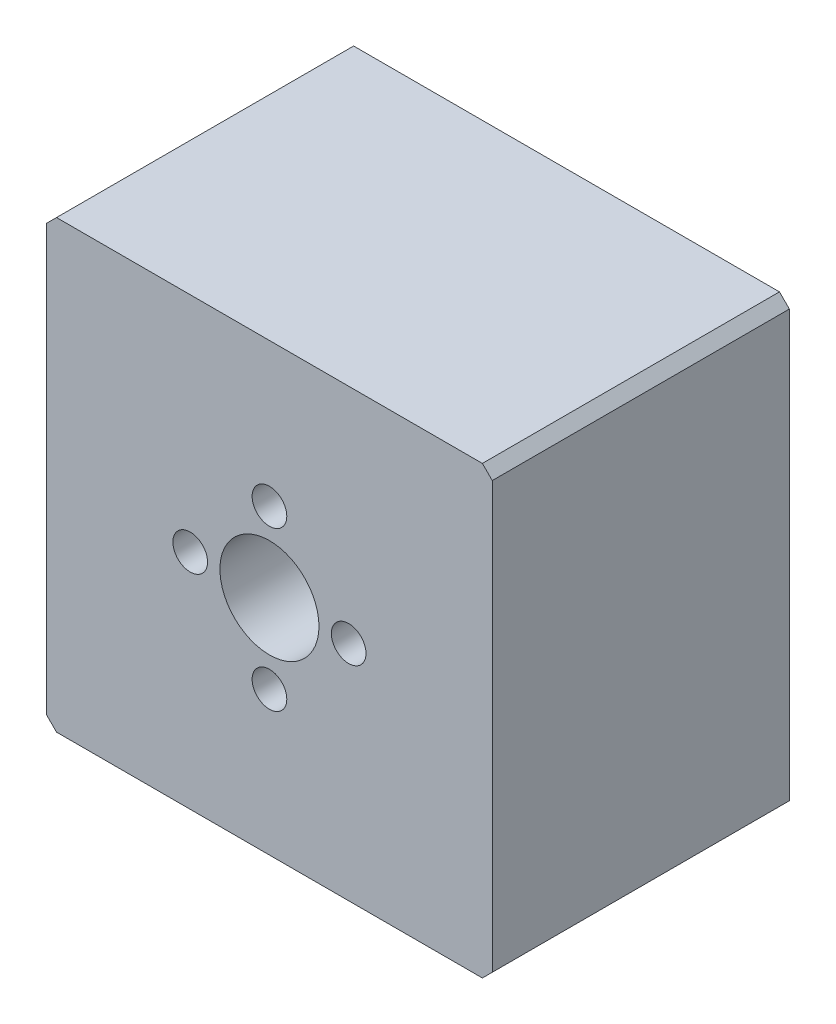
ISO-10303-21;
HEADER;
FILE_DESCRIPTION(('STEP AP214'),'2;1');
FILE_NAME('part.step','',(''),(''),'','','');
FILE_SCHEMA(('AUTOMOTIVE_DESIGN { 1 0 10303 214 1 1 1 1 }'));
ENDSEC;
DATA;
#1=APPLICATION_CONTEXT('core data for automotive mechanical design processes');
#2=APPLICATION_PROTOCOL_DEFINITION('international standard','automotive_design',2000,#1);
#3=PRODUCT_CONTEXT('',#1,'mechanical');
#4=PRODUCT('Part','Part','',(#3));
#5=PRODUCT_RELATED_PRODUCT_CATEGORY('part','',(#4));
#6=PRODUCT_DEFINITION_FORMATION('','',#4);
#7=PRODUCT_DEFINITION_CONTEXT('part definition',#1,'design');
#8=PRODUCT_DEFINITION('design','',#6,#7);
#9=PRODUCT_DEFINITION_SHAPE('','',#8);
#10=(LENGTH_UNIT() NAMED_UNIT(*) SI_UNIT(.MILLI.,.METRE.));
#11=(NAMED_UNIT(*) PLANE_ANGLE_UNIT() SI_UNIT($,.RADIAN.));
#12=(NAMED_UNIT(*) SI_UNIT($,.STERADIAN.) SOLID_ANGLE_UNIT());
#13=UNCERTAINTY_MEASURE_WITH_UNIT(LENGTH_MEASURE(1.E-05),#10,'distance_accuracy_value','');
#14=(GEOMETRIC_REPRESENTATION_CONTEXT(3) GLOBAL_UNCERTAINTY_ASSIGNED_CONTEXT((#13)) GLOBAL_UNIT_ASSIGNED_CONTEXT((#10,
#11,#12)) REPRESENTATION_CONTEXT('',''));
#15=CARTESIAN_POINT('',(0.,0.,0.));
#16=DIRECTION('',(0.,0.,1.));
#17=DIRECTION('',(1.,0.,0.));
#18=AXIS2_PLACEMENT_3D('',#15,#16,#17);
#19=CARTESIAN_POINT('',(0.,0.,15.));
#20=DIRECTION('',(0.,0.,-1.));
#21=DIRECTION('',(-1.,0.,0.));
#22=AXIS2_PLACEMENT_3D('',#19,#20,#21);
#23=PLANE('',#22);
#24=CARTESIAN_POINT('',(0.,5.50000000000001,15.));
#25=DIRECTION('',(0.,0.,1.));
#26=DIRECTION('',(1.,0.,0.));
#27=AXIS2_PLACEMENT_3D('',#24,#25,#26);
#28=CIRCLE('',#27,1.75000000000036);
#29=CARTESIAN_POINT('',(1.75000000000036,5.50000000000001,15.));
#30=VERTEX_POINT('',#29);
#31=EDGE_CURVE('E207',#30,#30,#28,.T.);
#32=ORIENTED_EDGE('',*,*,#31,.F.);
#33=EDGE_LOOP('',(#32));
#34=FACE_BOUND('',#33,.T.);
#35=CARTESIAN_POINT('',(0.,-10.5,15.));
#36=DIRECTION('',(0.,0.,1.));
#37=DIRECTION('',(1.,0.,0.));
#38=AXIS2_PLACEMENT_3D('',#35,#36,#37);
#39=CIRCLE('',#38,1.75000000000036);
#40=CARTESIAN_POINT('',(1.75000000000036,-10.5,15.));
#41=VERTEX_POINT('',#40);
#42=EDGE_CURVE('E201',#41,#41,#39,.T.);
#43=ORIENTED_EDGE('',*,*,#42,.F.);
#44=EDGE_LOOP('',(#43));
#45=FACE_BOUND('',#44,.T.);
#46=CARTESIAN_POINT('',(8.00000000000001,-2.5,15.));
#47=DIRECTION('',(0.,0.,1.));
#48=DIRECTION('',(1.,0.,0.));
#49=AXIS2_PLACEMENT_3D('',#46,#47,#48);
#50=CIRCLE('',#49,1.75000000000036);
#51=CARTESIAN_POINT('',(9.75000000000037,-2.5,15.));
#52=VERTEX_POINT('',#51);
#53=EDGE_CURVE('E195',#52,#52,#50,.T.);
#54=ORIENTED_EDGE('',*,*,#53,.F.);
#55=EDGE_LOOP('',(#54));
#56=FACE_BOUND('',#55,.T.);
#57=CARTESIAN_POINT('',(-8.00000000000001,-2.5,15.));
#58=DIRECTION('',(0.,0.,1.));
#59=DIRECTION('',(1.,0.,0.));
#60=AXIS2_PLACEMENT_3D('',#57,#58,#59);
#61=CIRCLE('',#60,1.75000000000036);
#62=CARTESIAN_POINT('',(-6.24999999999964,-2.5,15.));
#63=VERTEX_POINT('',#62);
#64=EDGE_CURVE('E188',#63,#63,#61,.T.);
#65=ORIENTED_EDGE('',*,*,#64,.F.);
#66=EDGE_LOOP('',(#65));
#67=FACE_BOUND('',#66,.T.);
#68=DIRECTION('',(0.,-1.,0.));
#69=VECTOR('',#68,1.);
#70=CARTESIAN_POINT('',(-22.5,-24.9999999999999,15.));
#71=LINE('',#70,#69);
#72=CARTESIAN_POINT('',(-22.5,19.,15.));
#73=VERTEX_POINT('',#72);
#74=CARTESIAN_POINT('',(-22.5,-23.9999999999999,15.));
#75=VERTEX_POINT('',#74);
#76=EDGE_CURVE('E137',#73,#75,#71,.T.);
#77=ORIENTED_EDGE('',*,*,#76,.T.);
#78=DIRECTION('',(-0.707106781186548,0.707106781186548,0.));
#79=VECTOR('',#78,1.);
#80=CARTESIAN_POINT('',(-21.5,-24.9999999999999,15.));
#81=LINE('',#80,#79);
#82=CARTESIAN_POINT('',(-21.5,-24.9999999999999,15.));
#83=VERTEX_POINT('',#82);
#84=EDGE_CURVE('E152',#75,#83,#81,.F.);
#85=ORIENTED_EDGE('',*,*,#84,.T.);
#86=DIRECTION('',(1.,0.,0.));
#87=VECTOR('',#86,1.);
#88=CARTESIAN_POINT('',(22.5,-24.9999999999999,15.));
#89=LINE('',#88,#87);
#90=CARTESIAN_POINT('',(21.5,-24.9999999999999,15.));
#91=VERTEX_POINT('',#90);
#92=EDGE_CURVE('E119',#83,#91,#89,.T.);
#93=ORIENTED_EDGE('',*,*,#92,.T.);
#94=DIRECTION('',(-0.707106781186548,-0.707106781186548,0.));
#95=VECTOR('',#94,1.);
#96=CARTESIAN_POINT('',(22.5,-23.9999999999999,15.));
#97=LINE('',#96,#95);
#98=CARTESIAN_POINT('',(22.5,-23.9999999999999,15.));
#99=VERTEX_POINT('',#98);
#100=EDGE_CURVE('E150',#91,#99,#97,.F.);
#101=ORIENTED_EDGE('',*,*,#100,.T.);
#102=DIRECTION('',(0.,1.,0.));
#103=VECTOR('',#102,1.);
#104=CARTESIAN_POINT('',(22.5,20.,15.));
#105=LINE('',#104,#103);
#106=CARTESIAN_POINT('',(22.5,19.,15.));
#107=VERTEX_POINT('',#106);
#108=EDGE_CURVE('E172',#99,#107,#105,.T.);
#109=ORIENTED_EDGE('',*,*,#108,.T.);
#110=DIRECTION('',(0.707106781186548,-0.707106781186548,0.));
#111=VECTOR('',#110,1.);
#112=CARTESIAN_POINT('',(21.5,20.,15.));
#113=LINE('',#112,#111);
#114=CARTESIAN_POINT('',(21.5,20.,15.));
#115=VERTEX_POINT('',#114);
#116=EDGE_CURVE('E54',#107,#115,#113,.F.);
#117=ORIENTED_EDGE('',*,*,#116,.T.);
#118=DIRECTION('',(-1.,0.,0.));
#119=VECTOR('',#118,1.);
#120=CARTESIAN_POINT('',(-22.5,20.,15.));
#121=LINE('',#120,#119);
#122=CARTESIAN_POINT('',(-21.5,20.,15.));
#123=VERTEX_POINT('',#122);
#124=EDGE_CURVE('E138',#115,#123,#121,.T.);
#125=ORIENTED_EDGE('',*,*,#124,.T.);
#126=DIRECTION('',(0.707106781186548,0.707106781186548,0.));
#127=VECTOR('',#126,1.);
#128=CARTESIAN_POINT('',(-22.5,19.,15.));
#129=LINE('',#128,#127);
#130=EDGE_CURVE('E148',#123,#73,#129,.F.);
#131=ORIENTED_EDGE('',*,*,#130,.T.);
#132=EDGE_LOOP('',(#77,#85,#93,#101,#109,#117,#125,#131));
#133=FACE_BOUND('',#132,.T.);
#134=CARTESIAN_POINT('',(0.,-2.5,15.));
#135=DIRECTION('',(0.,0.,1.));
#136=DIRECTION('',(1.,0.,0.));
#137=AXIS2_PLACEMENT_3D('',#134,#135,#136);
#138=CIRCLE('',#137,4.99999999999989);
#139=CARTESIAN_POINT('',(4.99999999999989,-2.5,15.));
#140=VERTEX_POINT('',#139);
#141=EDGE_CURVE('E132',#140,#140,#138,.T.);
#142=ORIENTED_EDGE('',*,*,#141,.F.);
#143=EDGE_LOOP('',(#142));
#144=FACE_BOUND('',#143,.T.);
#145=ADVANCED_FACE('F34',(#34,#45,#56,#67,#133,#144),#23,.F.);
#146=CARTESIAN_POINT('',(0.,0.,-15.));
#147=DIRECTION('',(0.,0.,-1.));
#148=DIRECTION('',(-1.,0.,0.));
#149=AXIS2_PLACEMENT_3D('',#146,#147,#148);
#150=PLANE('',#149);
#151=DIRECTION('',(1.,0.,0.));
#152=VECTOR('',#151,1.);
#153=CARTESIAN_POINT('',(22.5,-24.9999999999999,-15.));
#154=LINE('',#153,#152);
#155=CARTESIAN_POINT('',(-21.5,-24.9999999999999,-15.));
#156=VERTEX_POINT('',#155);
#157=CARTESIAN_POINT('',(21.5,-24.9999999999999,-15.));
#158=VERTEX_POINT('',#157);
#159=EDGE_CURVE('E116',#156,#158,#154,.T.);
#160=ORIENTED_EDGE('',*,*,#159,.F.);
#161=DIRECTION('',(0.707106781186548,-0.707106781186548,0.));
#162=VECTOR('',#161,1.);
#163=CARTESIAN_POINT('',(-23.2499999999999,-23.2499999999999,-15.));
#164=LINE('',#163,#162);
#165=CARTESIAN_POINT('',(-22.5,-23.9999999999999,-15.));
#166=VERTEX_POINT('',#165);
#167=EDGE_CURVE('E99',#156,#166,#164,.F.);
#168=ORIENTED_EDGE('',*,*,#167,.T.);
#169=DIRECTION('',(0.,-1.,0.));
#170=VECTOR('',#169,1.);
#171=CARTESIAN_POINT('',(-22.5,-24.9999999999999,-15.));
#172=LINE('',#171,#170);
#173=CARTESIAN_POINT('',(-22.5,19.,-15.));
#174=VERTEX_POINT('',#173);
#175=EDGE_CURVE('E127',#174,#166,#172,.T.);
#176=ORIENTED_EDGE('',*,*,#175,.F.);
#177=DIRECTION('',(-0.707106781186548,-0.707106781186548,0.));
#178=VECTOR('',#177,1.);
#179=CARTESIAN_POINT('',(-20.75,20.75,-15.));
#180=LINE('',#179,#178);
#181=CARTESIAN_POINT('',(-21.5,20.,-15.));
#182=VERTEX_POINT('',#181);
#183=EDGE_CURVE('E141',#174,#182,#180,.F.);
#184=ORIENTED_EDGE('',*,*,#183,.T.);
#185=DIRECTION('',(-1.,0.,0.));
#186=VECTOR('',#185,1.);
#187=CARTESIAN_POINT('',(-22.5,20.,-15.));
#188=LINE('',#187,#186);
#189=CARTESIAN_POINT('',(21.5,20.,-15.));
#190=VERTEX_POINT('',#189);
#191=EDGE_CURVE('E130',#190,#182,#188,.T.);
#192=ORIENTED_EDGE('',*,*,#191,.F.);
#193=DIRECTION('',(-0.707106781186548,0.707106781186548,0.));
#194=VECTOR('',#193,1.);
#195=CARTESIAN_POINT('',(20.75,20.75,-15.));
#196=LINE('',#195,#194);
#197=CARTESIAN_POINT('',(22.5,19.,-15.));
#198=VERTEX_POINT('',#197);
#199=EDGE_CURVE('E120',#190,#198,#196,.F.);
#200=ORIENTED_EDGE('',*,*,#199,.T.);
#201=DIRECTION('',(0.,1.,0.));
#202=VECTOR('',#201,1.);
#203=CARTESIAN_POINT('',(22.5,20.,-15.));
#204=LINE('',#203,#202);
#205=CARTESIAN_POINT('',(22.5,-23.9999999999999,-15.));
#206=VERTEX_POINT('',#205);
#207=EDGE_CURVE('E126',#206,#198,#204,.T.);
#208=ORIENTED_EDGE('',*,*,#207,.F.);
#209=DIRECTION('',(0.707106781186548,0.707106781186548,0.));
#210=VECTOR('',#209,1.);
#211=CARTESIAN_POINT('',(23.2499999999999,-23.2499999999999,-15.));
#212=LINE('',#211,#210);
#213=EDGE_CURVE('E110',#206,#158,#212,.F.);
#214=ORIENTED_EDGE('',*,*,#213,.T.);
#215=EDGE_LOOP('',(#160,#168,#176,#184,#192,#200,#208,#214));
#216=FACE_BOUND('',#215,.T.);
#217=CARTESIAN_POINT('',(0.,-2.5,-15.));
#218=DIRECTION('',(0.,0.,1.));
#219=DIRECTION('',(1.,0.,0.));
#220=AXIS2_PLACEMENT_3D('',#217,#218,#219);
#221=CIRCLE('',#220,4.99999999999989);
#222=CARTESIAN_POINT('',(4.99999999999989,-2.5,-15.));
#223=VERTEX_POINT('',#222);
#224=EDGE_CURVE('E175',#223,#223,#221,.T.);
#225=ORIENTED_EDGE('',*,*,#224,.T.);
#226=EDGE_LOOP('',(#225));
#227=FACE_BOUND('',#226,.T.);
#228=ADVANCED_FACE('F123',(#216,#227),#150,.T.);
#229=CARTESIAN_POINT('',(-22.5,-24.9999999999999,15.));
#230=DIRECTION('',(1.,0.,0.));
#231=DIRECTION('',(0.,0.,-1.));
#232=AXIS2_PLACEMENT_3D('',#229,#230,#231);
#233=PLANE('',#232);
#234=ORIENTED_EDGE('',*,*,#175,.T.);
#235=DIRECTION('',(0.,0.,1.));
#236=VECTOR('',#235,1.);
#237=CARTESIAN_POINT('',(-22.5,-23.9999999999999,15.));
#238=LINE('',#237,#236);
#239=EDGE_CURVE('E104',#166,#75,#238,.T.);
#240=ORIENTED_EDGE('',*,*,#239,.T.);
#241=ORIENTED_EDGE('',*,*,#76,.F.);
#242=DIRECTION('',(0.,0.,-1.));
#243=VECTOR('',#242,1.);
#244=CARTESIAN_POINT('',(-22.5,19.,15.));
#245=LINE('',#244,#243);
#246=EDGE_CURVE('E109',#73,#174,#245,.T.);
#247=ORIENTED_EDGE('',*,*,#246,.T.);
#248=EDGE_LOOP('',(#234,#240,#241,#247));
#249=FACE_BOUND('',#248,.T.);
#250=ADVANCED_FACE('F169',(#249),#233,.F.);
#251=CARTESIAN_POINT('',(22.5,-24.9999999999999,15.));
#252=DIRECTION('',(0.,1.,0.));
#253=DIRECTION('',(0.,0.,1.));
#254=AXIS2_PLACEMENT_3D('',#251,#252,#253);
#255=PLANE('',#254);
#256=CARTESIAN_POINT('',(-15.,-24.9999999999999,-8.));
#257=DIRECTION('',(0.,-1.,0.));
#258=DIRECTION('',(0.,0.,-1.));
#259=AXIS2_PLACEMENT_3D('',#256,#257,#258);
#260=CIRCLE('',#259,2.);
#261=CARTESIAN_POINT('',(-15.,-24.9999999999999,-10.));
#262=VERTEX_POINT('',#261);
#263=EDGE_CURVE('E218',#262,#262,#260,.T.);
#264=ORIENTED_EDGE('',*,*,#263,.F.);
#265=EDGE_LOOP('',(#264));
#266=FACE_BOUND('',#265,.T.);
#267=CARTESIAN_POINT('',(15.,-24.9999999999999,-8.));
#268=DIRECTION('',(0.,-1.,0.));
#269=DIRECTION('',(0.,0.,-1.));
#270=AXIS2_PLACEMENT_3D('',#267,#268,#269);
#271=CIRCLE('',#270,2.);
#272=CARTESIAN_POINT('',(15.,-24.9999999999999,-10.));
#273=VERTEX_POINT('',#272);
#274=EDGE_CURVE('E224',#273,#273,#271,.T.);
#275=ORIENTED_EDGE('',*,*,#274,.F.);
#276=EDGE_LOOP('',(#275));
#277=FACE_BOUND('',#276,.T.);
#278=CARTESIAN_POINT('',(15.,-24.9999999999999,8.));
#279=DIRECTION('',(0.,-1.,0.));
#280=DIRECTION('',(0.,0.,-1.));
#281=AXIS2_PLACEMENT_3D('',#278,#279,#280);
#282=CIRCLE('',#281,2.);
#283=CARTESIAN_POINT('',(15.,-24.9999999999999,6.));
#284=VERTEX_POINT('',#283);
#285=EDGE_CURVE('E230',#284,#284,#282,.T.);
#286=ORIENTED_EDGE('',*,*,#285,.F.);
#287=EDGE_LOOP('',(#286));
#288=FACE_BOUND('',#287,.T.);
#289=CARTESIAN_POINT('',(-15.,-24.9999999999999,8.));
#290=DIRECTION('',(0.,-1.,0.));
#291=DIRECTION('',(0.,0.,-1.));
#292=AXIS2_PLACEMENT_3D('',#289,#290,#291);
#293=CIRCLE('',#292,2.);
#294=CARTESIAN_POINT('',(-15.,-24.9999999999999,6.));
#295=VERTEX_POINT('',#294);
#296=EDGE_CURVE('E212',#295,#295,#293,.T.);
#297=ORIENTED_EDGE('',*,*,#296,.F.);
#298=EDGE_LOOP('',(#297));
#299=FACE_BOUND('',#298,.T.);
#300=ORIENTED_EDGE('',*,*,#92,.F.);
#301=DIRECTION('',(0.,0.,-1.));
#302=VECTOR('',#301,1.);
#303=CARTESIAN_POINT('',(-21.5,-24.9999999999999,15.));
#304=LINE('',#303,#302);
#305=EDGE_CURVE('E103',#83,#156,#304,.T.);
#306=ORIENTED_EDGE('',*,*,#305,.T.);
#307=ORIENTED_EDGE('',*,*,#159,.T.);
#308=DIRECTION('',(0.,0.,1.));
#309=VECTOR('',#308,1.);
#310=CARTESIAN_POINT('',(21.5,-24.9999999999999,15.));
#311=LINE('',#310,#309);
#312=EDGE_CURVE('E121',#158,#91,#311,.T.);
#313=ORIENTED_EDGE('',*,*,#312,.T.);
#314=EDGE_LOOP('',(#300,#306,#307,#313));
#315=FACE_BOUND('',#314,.T.);
#316=ADVANCED_FACE('F115',(#266,#277,#288,#299,#315),#255,.F.);
#317=CARTESIAN_POINT('',(22.5,20.,15.));
#318=DIRECTION('',(-1.,0.,0.));
#319=DIRECTION('',(0.,0.,1.));
#320=AXIS2_PLACEMENT_3D('',#317,#318,#319);
#321=PLANE('',#320);
#322=ORIENTED_EDGE('',*,*,#108,.F.);
#323=DIRECTION('',(0.,0.,-1.));
#324=VECTOR('',#323,1.);
#325=CARTESIAN_POINT('',(22.5,-23.9999999999999,15.));
#326=LINE('',#325,#324);
#327=EDGE_CURVE('E156',#99,#206,#326,.T.);
#328=ORIENTED_EDGE('',*,*,#327,.T.);
#329=ORIENTED_EDGE('',*,*,#207,.T.);
#330=DIRECTION('',(0.,0.,1.));
#331=VECTOR('',#330,1.);
#332=CARTESIAN_POINT('',(22.5,19.,15.));
#333=LINE('',#332,#331);
#334=EDGE_CURVE('E154',#198,#107,#333,.T.);
#335=ORIENTED_EDGE('',*,*,#334,.T.);
#336=EDGE_LOOP('',(#322,#328,#329,#335));
#337=FACE_BOUND('',#336,.T.);
#338=ADVANCED_FACE('F247',(#337),#321,.F.);
#339=CARTESIAN_POINT('',(-22.5,20.,15.));
#340=DIRECTION('',(0.,-1.,0.));
#341=DIRECTION('',(0.,0.,-1.));
#342=AXIS2_PLACEMENT_3D('',#339,#340,#341);
#343=PLANE('',#342);
#344=ORIENTED_EDGE('',*,*,#191,.T.);
#345=DIRECTION('',(0.,0.,1.));
#346=VECTOR('',#345,1.);
#347=CARTESIAN_POINT('',(-21.5,20.,15.));
#348=LINE('',#347,#346);
#349=EDGE_CURVE('E11',#182,#123,#348,.T.);
#350=ORIENTED_EDGE('',*,*,#349,.T.);
#351=ORIENTED_EDGE('',*,*,#124,.F.);
#352=DIRECTION('',(0.,0.,-1.));
#353=VECTOR('',#352,1.);
#354=CARTESIAN_POINT('',(21.5,20.,15.));
#355=LINE('',#354,#353);
#356=EDGE_CURVE('E42',#115,#190,#355,.T.);
#357=ORIENTED_EDGE('',*,*,#356,.T.);
#358=EDGE_LOOP('',(#344,#350,#351,#357));
#359=FACE_BOUND('',#358,.T.);
#360=ADVANCED_FACE('F161',(#359),#343,.F.);
#361=CARTESIAN_POINT('',(0.,-2.5,15.));
#362=DIRECTION('',(0.,0.,-1.));
#363=DIRECTION('',(-1.,0.,0.));
#364=AXIS2_PLACEMENT_3D('',#361,#362,#363);
#365=CYLINDRICAL_SURFACE('',#364,4.99999999999989);
#366=ORIENTED_EDGE('',*,*,#141,.T.);
#367=EDGE_LOOP('',(#366));
#368=FACE_BOUND('',#367,.T.);
#369=ORIENTED_EDGE('',*,*,#224,.F.);
#370=EDGE_LOOP('',(#369));
#371=FACE_BOUND('',#370,.T.);
#372=ADVANCED_FACE('F296',(#368,#371),#365,.F.);
#373=CARTESIAN_POINT('',(-8.00000000000001,-2.5,5.));
#374=DIRECTION('',(0.,0.,1.));
#375=DIRECTION('',(1.,0.,0.));
#376=AXIS2_PLACEMENT_3D('',#373,#374,#375);
#377=CYLINDRICAL_SURFACE('',#376,1.75000000000036);
#378=CARTESIAN_POINT('',(-8.00000000000001,-2.5,5.));
#379=DIRECTION('',(0.,0.,1.));
#380=DIRECTION('',(1.,0.,0.));
#381=AXIS2_PLACEMENT_3D('',#378,#379,#380);
#382=CIRCLE('',#381,1.75000000000036);
#383=CARTESIAN_POINT('',(-6.24999999999964,-2.5,5.));
#384=VERTEX_POINT('',#383);
#385=EDGE_CURVE('E191',#384,#384,#382,.T.);
#386=ORIENTED_EDGE('',*,*,#385,.F.);
#387=EDGE_LOOP('',(#386));
#388=FACE_BOUND('',#387,.T.);
#389=ORIENTED_EDGE('',*,*,#64,.T.);
#390=EDGE_LOOP('',(#389));
#391=FACE_BOUND('',#390,.T.);
#392=ADVANCED_FACE('F292',(#388,#391),#377,.F.);
#393=CARTESIAN_POINT('',(-8.00000000000001,-2.5,5.));
#394=DIRECTION('',(0.,0.,1.));
#395=DIRECTION('',(1.,0.,0.));
#396=AXIS2_PLACEMENT_3D('',#393,#394,#395);
#397=PLANE('',#396);
#398=ORIENTED_EDGE('',*,*,#385,.T.);
#399=EDGE_LOOP('',(#398));
#400=FACE_BOUND('',#399,.T.);
#401=ADVANCED_FACE('F288',(#400),#397,.T.);
#402=CARTESIAN_POINT('',(8.00000000000001,-2.5,5.));
#403=DIRECTION('',(0.,0.,1.));
#404=DIRECTION('',(1.,0.,0.));
#405=AXIS2_PLACEMENT_3D('',#402,#403,#404);
#406=CYLINDRICAL_SURFACE('',#405,1.75000000000036);
#407=CARTESIAN_POINT('',(8.00000000000001,-2.5,5.));
#408=DIRECTION('',(0.,0.,1.));
#409=DIRECTION('',(1.,0.,0.));
#410=AXIS2_PLACEMENT_3D('',#407,#408,#409);
#411=CIRCLE('',#410,1.75000000000036);
#412=CARTESIAN_POINT('',(9.75000000000037,-2.5,5.));
#413=VERTEX_POINT('',#412);
#414=EDGE_CURVE('E198',#413,#413,#411,.T.);
#415=ORIENTED_EDGE('',*,*,#414,.F.);
#416=EDGE_LOOP('',(#415));
#417=FACE_BOUND('',#416,.T.);
#418=ORIENTED_EDGE('',*,*,#53,.T.);
#419=EDGE_LOOP('',(#418));
#420=FACE_BOUND('',#419,.T.);
#421=ADVANCED_FACE('F284',(#417,#420),#406,.F.);
#422=CARTESIAN_POINT('',(8.00000000000001,-2.5,5.));
#423=DIRECTION('',(0.,0.,1.));
#424=DIRECTION('',(1.,0.,0.));
#425=AXIS2_PLACEMENT_3D('',#422,#423,#424);
#426=PLANE('',#425);
#427=ORIENTED_EDGE('',*,*,#414,.T.);
#428=EDGE_LOOP('',(#427));
#429=FACE_BOUND('',#428,.T.);
#430=ADVANCED_FACE('F280',(#429),#426,.T.);
#431=CARTESIAN_POINT('',(0.,-10.5,5.));
#432=DIRECTION('',(0.,0.,1.));
#433=DIRECTION('',(1.,0.,0.));
#434=AXIS2_PLACEMENT_3D('',#431,#432,#433);
#435=CYLINDRICAL_SURFACE('',#434,1.75000000000036);
#436=CARTESIAN_POINT('',(0.,-10.5,5.));
#437=DIRECTION('',(0.,0.,1.));
#438=DIRECTION('',(1.,0.,0.));
#439=AXIS2_PLACEMENT_3D('',#436,#437,#438);
#440=CIRCLE('',#439,1.75000000000036);
#441=CARTESIAN_POINT('',(1.75000000000036,-10.5,5.));
#442=VERTEX_POINT('',#441);
#443=EDGE_CURVE('E204',#442,#442,#440,.T.);
#444=ORIENTED_EDGE('',*,*,#443,.F.);
#445=EDGE_LOOP('',(#444));
#446=FACE_BOUND('',#445,.T.);
#447=ORIENTED_EDGE('',*,*,#42,.T.);
#448=EDGE_LOOP('',(#447));
#449=FACE_BOUND('',#448,.T.);
#450=ADVANCED_FACE('F276',(#446,#449),#435,.F.);
#451=CARTESIAN_POINT('',(0.,-10.5,5.));
#452=DIRECTION('',(0.,0.,1.));
#453=DIRECTION('',(1.,0.,0.));
#454=AXIS2_PLACEMENT_3D('',#451,#452,#453);
#455=PLANE('',#454);
#456=ORIENTED_EDGE('',*,*,#443,.T.);
#457=EDGE_LOOP('',(#456));
#458=FACE_BOUND('',#457,.T.);
#459=ADVANCED_FACE('F272',(#458),#455,.T.);
#460=CARTESIAN_POINT('',(0.,5.50000000000001,5.));
#461=DIRECTION('',(0.,0.,1.));
#462=DIRECTION('',(1.,0.,0.));
#463=AXIS2_PLACEMENT_3D('',#460,#461,#462);
#464=CYLINDRICAL_SURFACE('',#463,1.75000000000036);
#465=CARTESIAN_POINT('',(0.,5.50000000000001,5.));
#466=DIRECTION('',(0.,0.,1.));
#467=DIRECTION('',(1.,0.,0.));
#468=AXIS2_PLACEMENT_3D('',#465,#466,#467);
#469=CIRCLE('',#468,1.75000000000036);
#470=CARTESIAN_POINT('',(1.75000000000036,5.50000000000001,5.));
#471=VERTEX_POINT('',#470);
#472=EDGE_CURVE('E186',#471,#471,#469,.T.);
#473=ORIENTED_EDGE('',*,*,#472,.F.);
#474=EDGE_LOOP('',(#473));
#475=FACE_BOUND('',#474,.T.);
#476=ORIENTED_EDGE('',*,*,#31,.T.);
#477=EDGE_LOOP('',(#476));
#478=FACE_BOUND('',#477,.T.);
#479=ADVANCED_FACE('F268',(#475,#478),#464,.F.);
#480=CARTESIAN_POINT('',(0.,5.50000000000001,5.));
#481=DIRECTION('',(0.,0.,1.));
#482=DIRECTION('',(1.,0.,0.));
#483=AXIS2_PLACEMENT_3D('',#480,#481,#482);
#484=PLANE('',#483);
#485=ORIENTED_EDGE('',*,*,#472,.T.);
#486=EDGE_LOOP('',(#485));
#487=FACE_BOUND('',#486,.T.);
#488=ADVANCED_FACE('F265',(#487),#484,.T.);
#489=CARTESIAN_POINT('',(-21.5,-24.9999999999999,15.));
#490=DIRECTION('',(0.707106781186547,0.707106781186547,0.));
#491=DIRECTION('',(0.,0.,-1.));
#492=AXIS2_PLACEMENT_3D('',#489,#490,#491);
#493=PLANE('',#492);
#494=ORIENTED_EDGE('',*,*,#84,.F.);
#495=ORIENTED_EDGE('',*,*,#239,.F.);
#496=ORIENTED_EDGE('',*,*,#167,.F.);
#497=ORIENTED_EDGE('',*,*,#305,.F.);
#498=EDGE_LOOP('',(#494,#495,#496,#497));
#499=FACE_BOUND('',#498,.T.);
#500=ADVANCED_FACE('F102',(#499),#493,.F.);
#501=CARTESIAN_POINT('',(22.5,-23.9999999999999,15.));
#502=DIRECTION('',(-0.707106781186547,0.707106781186547,0.));
#503=DIRECTION('',(0.,0.,-1.));
#504=AXIS2_PLACEMENT_3D('',#501,#502,#503);
#505=PLANE('',#504);
#506=ORIENTED_EDGE('',*,*,#100,.F.);
#507=ORIENTED_EDGE('',*,*,#312,.F.);
#508=ORIENTED_EDGE('',*,*,#213,.F.);
#509=ORIENTED_EDGE('',*,*,#327,.F.);
#510=EDGE_LOOP('',(#506,#507,#508,#509));
#511=FACE_BOUND('',#510,.T.);
#512=ADVANCED_FACE('F311',(#511),#505,.F.);
#513=CARTESIAN_POINT('',(-22.5,19.,15.));
#514=DIRECTION('',(0.707106781186547,-0.707106781186547,0.));
#515=DIRECTION('',(0.,0.,-1.));
#516=AXIS2_PLACEMENT_3D('',#513,#514,#515);
#517=PLANE('',#516);
#518=ORIENTED_EDGE('',*,*,#130,.F.);
#519=ORIENTED_EDGE('',*,*,#349,.F.);
#520=ORIENTED_EDGE('',*,*,#183,.F.);
#521=ORIENTED_EDGE('',*,*,#246,.F.);
#522=EDGE_LOOP('',(#518,#519,#520,#521));
#523=FACE_BOUND('',#522,.T.);
#524=ADVANCED_FACE('F166',(#523),#517,.F.);
#525=CARTESIAN_POINT('',(21.5,20.,15.));
#526=DIRECTION('',(-0.707106781186547,-0.707106781186547,0.));
#527=DIRECTION('',(0.,0.,-1.));
#528=AXIS2_PLACEMENT_3D('',#525,#526,#527);
#529=PLANE('',#528);
#530=ORIENTED_EDGE('',*,*,#116,.F.);
#531=ORIENTED_EDGE('',*,*,#334,.F.);
#532=ORIENTED_EDGE('',*,*,#199,.F.);
#533=ORIENTED_EDGE('',*,*,#356,.F.);
#534=EDGE_LOOP('',(#530,#531,#532,#533));
#535=FACE_BOUND('',#534,.T.);
#536=ADVANCED_FACE('F36',(#535),#529,.F.);
#537=CARTESIAN_POINT('',(-15.,-14.9999999999999,8.));
#538=DIRECTION('',(0.,-1.,0.));
#539=DIRECTION('',(0.,0.,-1.));
#540=AXIS2_PLACEMENT_3D('',#537,#538,#539);
#541=CYLINDRICAL_SURFACE('',#540,2.);
#542=CARTESIAN_POINT('',(-15.,-14.9999999999999,8.));
#543=DIRECTION('',(0.,-1.,0.));
#544=DIRECTION('',(0.,0.,-1.));
#545=AXIS2_PLACEMENT_3D('',#542,#543,#544);
#546=CIRCLE('',#545,2.);
#547=CARTESIAN_POINT('',(-15.,-14.9999999999999,6.));
#548=VERTEX_POINT('',#547);
#549=EDGE_CURVE('E192',#548,#548,#546,.T.);
#550=ORIENTED_EDGE('',*,*,#549,.F.);
#551=EDGE_LOOP('',(#550));
#552=FACE_BOUND('',#551,.T.);
#553=ORIENTED_EDGE('',*,*,#296,.T.);
#554=EDGE_LOOP('',(#553));
#555=FACE_BOUND('',#554,.T.);
#556=ADVANCED_FACE('F252',(#552,#555),#541,.F.);
#557=CARTESIAN_POINT('',(-15.,-14.9999999999999,8.));
#558=DIRECTION('',(0.,-1.,0.));
#559=DIRECTION('',(0.,0.,-1.));
#560=AXIS2_PLACEMENT_3D('',#557,#558,#559);
#561=PLANE('',#560);
#562=ORIENTED_EDGE('',*,*,#549,.T.);
#563=EDGE_LOOP('',(#562));
#564=FACE_BOUND('',#563,.T.);
#565=ADVANCED_FACE('F241',(#564),#561,.T.);
#566=CARTESIAN_POINT('',(15.,-14.9999999999999,8.));
#567=DIRECTION('',(0.,-1.,0.));
#568=DIRECTION('',(0.,0.,-1.));
#569=AXIS2_PLACEMENT_3D('',#566,#567,#568);
#570=CYLINDRICAL_SURFACE('',#569,2.);
#571=CARTESIAN_POINT('',(15.,-14.9999999999999,8.));
#572=DIRECTION('',(0.,-1.,0.));
#573=DIRECTION('',(0.,0.,-1.));
#574=AXIS2_PLACEMENT_3D('',#571,#572,#573);
#575=CIRCLE('',#574,2.);
#576=CARTESIAN_POINT('',(15.,-14.9999999999999,6.));
#577=VERTEX_POINT('',#576);
#578=EDGE_CURVE('E215',#577,#577,#575,.T.);
#579=ORIENTED_EDGE('',*,*,#578,.F.);
#580=EDGE_LOOP('',(#579));
#581=FACE_BOUND('',#580,.T.);
#582=ORIENTED_EDGE('',*,*,#285,.T.);
#583=EDGE_LOOP('',(#582));
#584=FACE_BOUND('',#583,.T.);
#585=ADVANCED_FACE('F238',(#581,#584),#570,.F.);
#586=CARTESIAN_POINT('',(15.,-14.9999999999999,8.));
#587=DIRECTION('',(0.,-1.,0.));
#588=DIRECTION('',(0.,0.,-1.));
#589=AXIS2_PLACEMENT_3D('',#586,#587,#588);
#590=PLANE('',#589);
#591=ORIENTED_EDGE('',*,*,#578,.T.);
#592=EDGE_LOOP('',(#591));
#593=FACE_BOUND('',#592,.T.);
#594=ADVANCED_FACE('F236',(#593),#590,.T.);
#595=CARTESIAN_POINT('',(15.,-14.9999999999999,-8.));
#596=DIRECTION('',(0.,-1.,0.));
#597=DIRECTION('',(0.,0.,-1.));
#598=AXIS2_PLACEMENT_3D('',#595,#596,#597);
#599=CYLINDRICAL_SURFACE('',#598,2.);
#600=CARTESIAN_POINT('',(15.,-14.9999999999999,-8.));
#601=DIRECTION('',(0.,-1.,0.));
#602=DIRECTION('',(0.,0.,-1.));
#603=AXIS2_PLACEMENT_3D('',#600,#601,#602);
#604=CIRCLE('',#603,2.);
#605=CARTESIAN_POINT('',(15.,-14.9999999999999,-10.));
#606=VERTEX_POINT('',#605);
#607=EDGE_CURVE('E227',#606,#606,#604,.T.);
#608=ORIENTED_EDGE('',*,*,#607,.F.);
#609=EDGE_LOOP('',(#608));
#610=FACE_BOUND('',#609,.T.);
#611=ORIENTED_EDGE('',*,*,#274,.T.);
#612=EDGE_LOOP('',(#611));
#613=FACE_BOUND('',#612,.T.);
#614=ADVANCED_FACE('F356',(#610,#613),#599,.F.);
#615=CARTESIAN_POINT('',(15.,-14.9999999999999,-8.));
#616=DIRECTION('',(0.,-1.,0.));
#617=DIRECTION('',(0.,0.,-1.));
#618=AXIS2_PLACEMENT_3D('',#615,#616,#617);
#619=PLANE('',#618);
#620=ORIENTED_EDGE('',*,*,#607,.T.);
#621=EDGE_LOOP('',(#620));
#622=FACE_BOUND('',#621,.T.);
#623=ADVANCED_FACE('F365',(#622),#619,.T.);
#624=CARTESIAN_POINT('',(-15.,-14.9999999999999,-8.));
#625=DIRECTION('',(0.,-1.,0.));
#626=DIRECTION('',(0.,0.,-1.));
#627=AXIS2_PLACEMENT_3D('',#624,#625,#626);
#628=CYLINDRICAL_SURFACE('',#627,2.);
#629=CARTESIAN_POINT('',(-15.,-14.9999999999999,-8.));
#630=DIRECTION('',(0.,-1.,0.));
#631=DIRECTION('',(0.,0.,-1.));
#632=AXIS2_PLACEMENT_3D('',#629,#630,#631);
#633=CIRCLE('',#632,2.);
#634=CARTESIAN_POINT('',(-15.,-14.9999999999999,-10.));
#635=VERTEX_POINT('',#634);
#636=EDGE_CURVE('E221',#635,#635,#633,.T.);
#637=ORIENTED_EDGE('',*,*,#636,.F.);
#638=EDGE_LOOP('',(#637));
#639=FACE_BOUND('',#638,.T.);
#640=ORIENTED_EDGE('',*,*,#263,.T.);
#641=EDGE_LOOP('',(#640));
#642=FACE_BOUND('',#641,.T.);
#643=ADVANCED_FACE('F375',(#639,#642),#628,.F.);
#644=CARTESIAN_POINT('',(-15.,-14.9999999999999,-8.));
#645=DIRECTION('',(0.,-1.,0.));
#646=DIRECTION('',(0.,0.,-1.));
#647=AXIS2_PLACEMENT_3D('',#644,#645,#646);
#648=PLANE('',#647);
#649=ORIENTED_EDGE('',*,*,#636,.T.);
#650=EDGE_LOOP('',(#649));
#651=FACE_BOUND('',#650,.T.);
#652=ADVANCED_FACE('F385',(#651),#648,.T.);
#653=CLOSED_SHELL('',(#145,#228,#250,#316,#338,#360,#372,#392,#401,#421,#430,#450,#459,#479,
#488,#500,#512,#524,#536,#556,#565,#585,#594,#614,#623,#643,#652));
#654=MANIFOLD_SOLID_BREP('B2',#653);
#655=ADVANCED_BREP_SHAPE_REPRESENTATION('',(#18,#654),#14);
#656=SHAPE_DEFINITION_REPRESENTATION(#9,#655);
ENDSEC;
END-ISO-10303-21;
